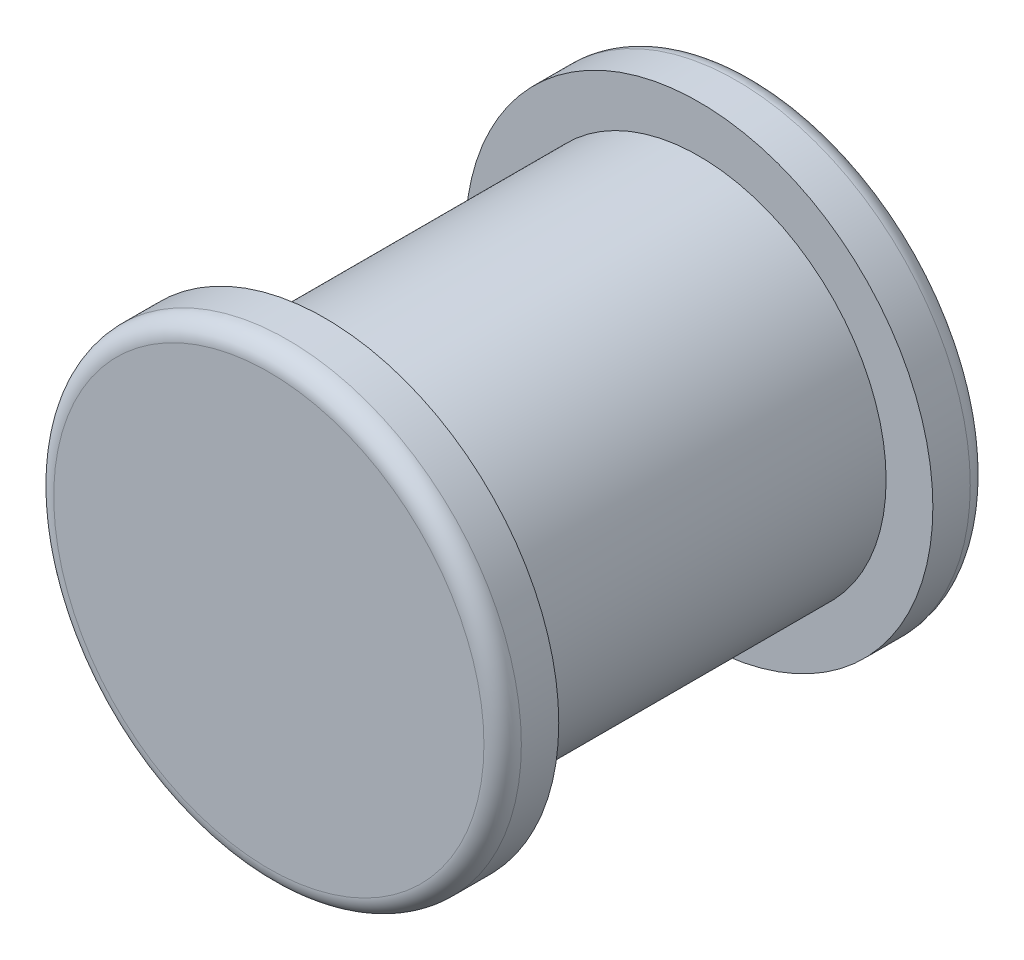
ISO-10303-21;
HEADER;
FILE_DESCRIPTION(('STEP AP214'),'2;1');
FILE_NAME('part.step','',(''),(''),'','','');
FILE_SCHEMA(('AUTOMOTIVE_DESIGN { 1 0 10303 214 1 1 1 1 }'));
ENDSEC;
DATA;
#1=APPLICATION_CONTEXT('core data for automotive mechanical design processes');
#2=APPLICATION_PROTOCOL_DEFINITION('international standard','automotive_design',2000,#1);
#3=PRODUCT_CONTEXT('',#1,'mechanical');
#4=PRODUCT('Part','Part','',(#3));
#5=PRODUCT_RELATED_PRODUCT_CATEGORY('part','',(#4));
#6=PRODUCT_DEFINITION_FORMATION('','',#4);
#7=PRODUCT_DEFINITION_CONTEXT('part definition',#1,'design');
#8=PRODUCT_DEFINITION('design','',#6,#7);
#9=PRODUCT_DEFINITION_SHAPE('','',#8);
#10=(LENGTH_UNIT() NAMED_UNIT(*) SI_UNIT(.MILLI.,.METRE.));
#11=(NAMED_UNIT(*) PLANE_ANGLE_UNIT() SI_UNIT($,.RADIAN.));
#12=(NAMED_UNIT(*) SI_UNIT($,.STERADIAN.) SOLID_ANGLE_UNIT());
#13=UNCERTAINTY_MEASURE_WITH_UNIT(LENGTH_MEASURE(1.E-05),#10,'distance_accuracy_value','');
#14=(GEOMETRIC_REPRESENTATION_CONTEXT(3) GLOBAL_UNCERTAINTY_ASSIGNED_CONTEXT((#13)) GLOBAL_UNIT_ASSIGNED_CONTEXT((#10,
#11,#12)) REPRESENTATION_CONTEXT('',''));
#15=CARTESIAN_POINT('',(0.,0.,0.));
#16=DIRECTION('',(0.,0.,1.));
#17=DIRECTION('',(1.,0.,0.));
#18=AXIS2_PLACEMENT_3D('',#15,#16,#17);
#19=CARTESIAN_POINT('',(0.,0.,20.));
#20=DIRECTION('',(0.,0.,-1.));
#21=DIRECTION('',(-1.,0.,0.));
#22=AXIS2_PLACEMENT_3D('',#19,#20,#21);
#23=CYLINDRICAL_SURFACE('',#22,10.);
#24=CARTESIAN_POINT('',(0.,0.,20.));
#25=DIRECTION('',(0.,0.,1.));
#26=DIRECTION('',(1.,0.,0.));
#27=AXIS2_PLACEMENT_3D('',#24,#25,#26);
#28=CIRCLE('',#27,10.);
#29=CARTESIAN_POINT('',(10.,0.,20.));
#30=VERTEX_POINT('',#29);
#31=EDGE_CURVE('E61',#30,#30,#28,.T.);
#32=ORIENTED_EDGE('',*,*,#31,.F.);
#33=EDGE_LOOP('',(#32));
#34=FACE_BOUND('',#33,.T.);
#35=CARTESIAN_POINT('',(0.,0.,0.));
#36=DIRECTION('',(0.,0.,1.));
#37=DIRECTION('',(1.,0.,0.));
#38=AXIS2_PLACEMENT_3D('',#35,#36,#37);
#39=CIRCLE('',#38,10.);
#40=CARTESIAN_POINT('',(10.,0.,0.));
#41=VERTEX_POINT('',#40);
#42=EDGE_CURVE('E62',#41,#41,#39,.T.);
#43=ORIENTED_EDGE('',*,*,#42,.T.);
#44=EDGE_LOOP('',(#43));
#45=FACE_BOUND('',#44,.T.);
#46=ADVANCED_FACE('F37',(#34,#45),#23,.T.);
#47=CARTESIAN_POINT('',(0.,0.,-3.));
#48=DIRECTION('',(0.,0.,1.));
#49=DIRECTION('',(1.,0.,0.));
#50=AXIS2_PLACEMENT_3D('',#47,#48,#49);
#51=CYLINDRICAL_SURFACE('',#50,12.5);
#52=CARTESIAN_POINT('',(0.,0.,-2.));
#53=DIRECTION('',(0.,0.,-1.));
#54=DIRECTION('',(-1.,0.,0.));
#55=AXIS2_PLACEMENT_3D('',#52,#53,#54);
#56=CIRCLE('',#55,12.5);
#57=CARTESIAN_POINT('',(-12.5,0.,-2.));
#58=VERTEX_POINT('',#57);
#59=EDGE_CURVE('E50',#58,#58,#56,.F.);
#60=ORIENTED_EDGE('',*,*,#59,.T.);
#61=EDGE_LOOP('',(#60));
#62=FACE_BOUND('',#61,.T.);
#63=CARTESIAN_POINT('',(0.,0.,0.));
#64=DIRECTION('',(0.,0.,-1.));
#65=DIRECTION('',(-1.,0.,0.));
#66=AXIS2_PLACEMENT_3D('',#63,#64,#65);
#67=CIRCLE('',#66,12.5);
#68=CARTESIAN_POINT('',(-12.5,0.,0.));
#69=VERTEX_POINT('',#68);
#70=EDGE_CURVE('E66',#69,#69,#67,.T.);
#71=ORIENTED_EDGE('',*,*,#70,.T.);
#72=EDGE_LOOP('',(#71));
#73=FACE_BOUND('',#72,.T.);
#74=ADVANCED_FACE('F95',(#62,#73),#51,.T.);
#75=CARTESIAN_POINT('',(0.,0.,-3.));
#76=DIRECTION('',(0.,0.,-1.));
#77=DIRECTION('',(-1.,0.,0.));
#78=AXIS2_PLACEMENT_3D('',#75,#76,#77);
#79=PLANE('',#78);
#80=CARTESIAN_POINT('',(0.,0.,-3.));
#81=DIRECTION('',(0.,0.,-1.));
#82=DIRECTION('',(-1.,0.,0.));
#83=AXIS2_PLACEMENT_3D('',#80,#81,#82);
#84=CIRCLE('',#83,11.5);
#85=CARTESIAN_POINT('',(-11.5,0.,-3.));
#86=VERTEX_POINT('',#85);
#87=EDGE_CURVE('E55',#86,#86,#84,.T.);
#88=ORIENTED_EDGE('',*,*,#87,.T.);
#89=EDGE_LOOP('',(#88));
#90=FACE_BOUND('',#89,.T.);
#91=ADVANCED_FACE('F101',(#90),#79,.T.);
#92=CARTESIAN_POINT('',(0.,0.,0.));
#93=DIRECTION('',(0.,0.,-1.));
#94=DIRECTION('',(-1.,0.,0.));
#95=AXIS2_PLACEMENT_3D('',#92,#93,#94);
#96=PLANE('',#95);
#97=ORIENTED_EDGE('',*,*,#42,.F.);
#98=EDGE_LOOP('',(#97));
#99=FACE_BOUND('',#98,.T.);
#100=ORIENTED_EDGE('',*,*,#70,.F.);
#101=EDGE_LOOP('',(#100));
#102=FACE_BOUND('',#101,.T.);
#103=ADVANCED_FACE('F90',(#99,#102),#96,.F.);
#104=CARTESIAN_POINT('',(0.,0.,-2.));
#105=DIRECTION('',(0.,0.,-1.));
#106=DIRECTION('',(-1.,0.,0.));
#107=AXIS2_PLACEMENT_3D('',#104,#105,#106);
#108=TOROIDAL_SURFACE('',#107,11.5,1.);
#109=ORIENTED_EDGE('',*,*,#59,.F.);
#110=EDGE_LOOP('',(#109));
#111=FACE_BOUND('',#110,.T.);
#112=ORIENTED_EDGE('',*,*,#87,.F.);
#113=EDGE_LOOP('',(#112));
#114=FACE_BOUND('',#113,.T.);
#115=ADVANCED_FACE('F83',(#111,#114),#108,.T.);
#116=CARTESIAN_POINT('',(0.,0.,23.));
#117=DIRECTION('',(0.,0.,-1.));
#118=DIRECTION('',(-1.,0.,0.));
#119=AXIS2_PLACEMENT_3D('',#116,#117,#118);
#120=CYLINDRICAL_SURFACE('',#119,12.5);
#121=CARTESIAN_POINT('',(0.,0.,22.));
#122=DIRECTION('',(0.,0.,1.));
#123=DIRECTION('',(1.,0.,0.));
#124=AXIS2_PLACEMENT_3D('',#121,#122,#123);
#125=CIRCLE('',#124,12.5);
#126=CARTESIAN_POINT('',(12.5,0.,22.));
#127=VERTEX_POINT('',#126);
#128=EDGE_CURVE('E45',#127,#127,#125,.F.);
#129=ORIENTED_EDGE('',*,*,#128,.T.);
#130=EDGE_LOOP('',(#129));
#131=FACE_BOUND('',#130,.T.);
#132=CARTESIAN_POINT('',(0.,0.,20.));
#133=DIRECTION('',(0.,0.,-1.));
#134=DIRECTION('',(-1.,0.,0.));
#135=AXIS2_PLACEMENT_3D('',#132,#133,#134);
#136=CIRCLE('',#135,12.5);
#137=CARTESIAN_POINT('',(-12.5,0.,20.));
#138=VERTEX_POINT('',#137);
#139=EDGE_CURVE('E73',#138,#138,#136,.T.);
#140=ORIENTED_EDGE('',*,*,#139,.F.);
#141=EDGE_LOOP('',(#140));
#142=FACE_BOUND('',#141,.T.);
#143=ADVANCED_FACE('F80',(#131,#142),#120,.T.);
#144=CARTESIAN_POINT('',(0.,0.,23.));
#145=DIRECTION('',(0.,0.,1.));
#146=DIRECTION('',(-1.,0.,0.));
#147=AXIS2_PLACEMENT_3D('',#144,#145,#146);
#148=PLANE('',#147);
#149=CARTESIAN_POINT('',(0.,0.,23.));
#150=DIRECTION('',(0.,0.,1.));
#151=DIRECTION('',(1.,0.,0.));
#152=AXIS2_PLACEMENT_3D('',#149,#150,#151);
#153=CIRCLE('',#152,11.5);
#154=CARTESIAN_POINT('',(11.5,0.,23.));
#155=VERTEX_POINT('',#154);
#156=EDGE_CURVE('E10',#155,#155,#153,.T.);
#157=ORIENTED_EDGE('',*,*,#156,.T.);
#158=EDGE_LOOP('',(#157));
#159=FACE_BOUND('',#158,.T.);
#160=ADVANCED_FACE('F82',(#159),#148,.T.);
#161=CARTESIAN_POINT('',(0.,0.,20.));
#162=DIRECTION('',(0.,0.,1.));
#163=DIRECTION('',(-1.,0.,0.));
#164=AXIS2_PLACEMENT_3D('',#161,#162,#163);
#165=PLANE('',#164);
#166=ORIENTED_EDGE('',*,*,#31,.T.);
#167=EDGE_LOOP('',(#166));
#168=FACE_BOUND('',#167,.T.);
#169=ORIENTED_EDGE('',*,*,#139,.T.);
#170=EDGE_LOOP('',(#169));
#171=FACE_BOUND('',#170,.T.);
#172=ADVANCED_FACE('F78',(#168,#171),#165,.F.);
#173=CARTESIAN_POINT('',(0.,0.,22.));
#174=DIRECTION('',(0.,0.,1.));
#175=DIRECTION('',(1.,0.,0.));
#176=AXIS2_PLACEMENT_3D('',#173,#174,#175);
#177=TOROIDAL_SURFACE('',#176,11.5,1.);
#178=ORIENTED_EDGE('',*,*,#156,.F.);
#179=EDGE_LOOP('',(#178));
#180=FACE_BOUND('',#179,.T.);
#181=ORIENTED_EDGE('',*,*,#128,.F.);
#182=EDGE_LOOP('',(#181));
#183=FACE_BOUND('',#182,.T.);
#184=ADVANCED_FACE('F39',(#180,#183),#177,.T.);
#185=CLOSED_SHELL('',(#46,#74,#91,#103,#115,#143,#160,#172,#184));
#186=MANIFOLD_SOLID_BREP('B2',#185);
#187=ADVANCED_BREP_SHAPE_REPRESENTATION('',(#18,#186),#14);
#188=SHAPE_DEFINITION_REPRESENTATION(#9,#187);
ENDSEC;
END-ISO-10303-21;
